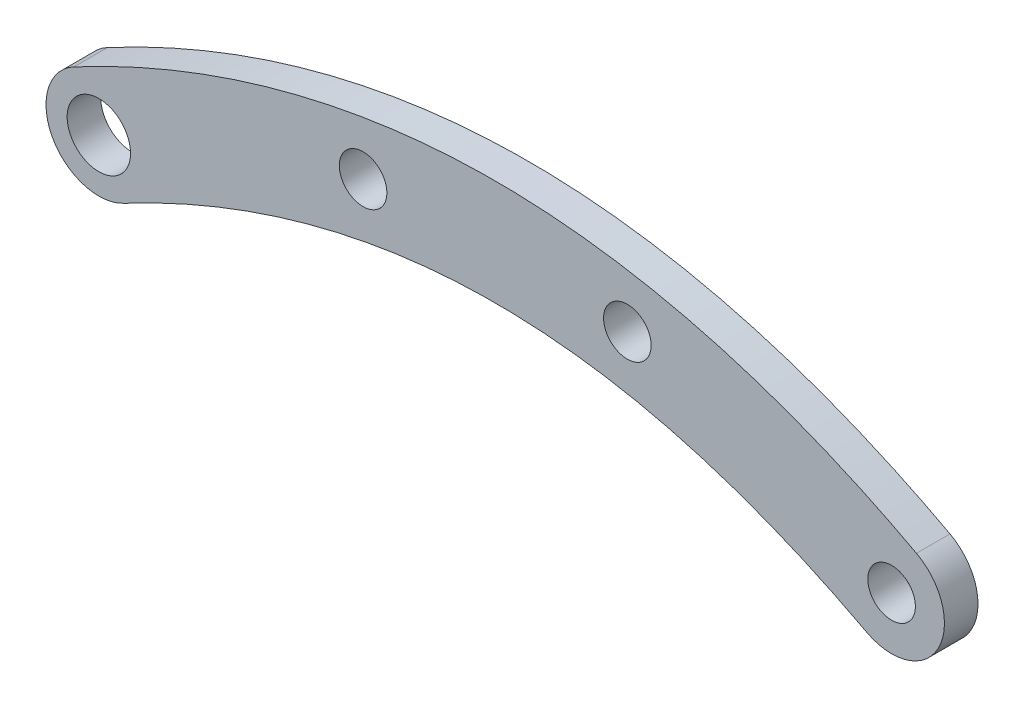
ISO-10303-21;
HEADER;
FILE_DESCRIPTION(('STEP AP214'),'2;1');
FILE_NAME('part.step','',(''),(''),'','','');
FILE_SCHEMA(('AUTOMOTIVE_DESIGN { 1 0 10303 214 1 1 1 1 }'));
ENDSEC;
DATA;
#1=APPLICATION_CONTEXT('core data for automotive mechanical design processes');
#2=APPLICATION_PROTOCOL_DEFINITION('international standard','automotive_design',2000,#1);
#3=PRODUCT_CONTEXT('',#1,'mechanical');
#4=PRODUCT('Part','Part','',(#3));
#5=PRODUCT_RELATED_PRODUCT_CATEGORY('part','',(#4));
#6=PRODUCT_DEFINITION_FORMATION('','',#4);
#7=PRODUCT_DEFINITION_CONTEXT('part definition',#1,'design');
#8=PRODUCT_DEFINITION('design','',#6,#7);
#9=PRODUCT_DEFINITION_SHAPE('','',#8);
#10=(LENGTH_UNIT() NAMED_UNIT(*) SI_UNIT(.MILLI.,.METRE.));
#11=(NAMED_UNIT(*) PLANE_ANGLE_UNIT() SI_UNIT($,.RADIAN.));
#12=(NAMED_UNIT(*) SI_UNIT($,.STERADIAN.) SOLID_ANGLE_UNIT());
#13=UNCERTAINTY_MEASURE_WITH_UNIT(LENGTH_MEASURE(1.E-05),#10,'distance_accuracy_value','');
#14=(GEOMETRIC_REPRESENTATION_CONTEXT(3) GLOBAL_UNCERTAINTY_ASSIGNED_CONTEXT((#13)) GLOBAL_UNIT_ASSIGNED_CONTEXT((#10,
#11,#12)) REPRESENTATION_CONTEXT('',''));
#15=CARTESIAN_POINT('',(0.,0.,0.));
#16=DIRECTION('',(0.,0.,1.));
#17=DIRECTION('',(1.,0.,0.));
#18=AXIS2_PLACEMENT_3D('',#15,#16,#17);
#19=CARTESIAN_POINT('',(-39.8529411764706,-5.58823529411765,1.5875));
#20=CARTESIAN_POINT('',(-25.0878353747758,2.31376151523475,1.5875));
#21=CARTESIAN_POINT('',(0.,5.67155962119131,1.5875));
#22=CARTESIAN_POINT('',(25.0878353747758,2.31376151523475,1.5875));
#23=CARTESIAN_POINT('',(39.8529411764706,-5.58823529411765,1.5875));
#24=B_SPLINE_CURVE_WITH_KNOTS('',2,(#19,#20,#21,#22,#23),.UNSPECIFIED.,.F.,.F.,(3,1,1,3),(0.,
0.375,0.625,1.),.UNSPECIFIED.);
#25=DIRECTION('',(0.,0.,-1.));
#26=VECTOR('',#25,1.);
#27=SURFACE_OF_LINEAR_EXTRUSION('',#24,#26);
#28=CARTESIAN_POINT('',(-39.8529411764706,-5.58823529411765,-1.5875));
#29=CARTESIAN_POINT('',(-25.0878353747758,2.31376151523475,-1.5875));
#30=CARTESIAN_POINT('',(0.,5.67155962119131,-1.5875));
#31=CARTESIAN_POINT('',(25.0878353747758,2.31376151523475,-1.5875));
#32=CARTESIAN_POINT('',(39.8529411764706,-5.58823529411765,-1.5875));
#33=B_SPLINE_CURVE_WITH_KNOTS('',2,(#28,#29,#30,#31,#32),.UNSPECIFIED.,.F.,.F.,(3,1,1,3),(0.,
0.375,0.625,1.),.UNSPECIFIED.);
#34=CARTESIAN_POINT('',(-39.8529411764706,-5.58823529411764,-1.5875));
#35=VERTEX_POINT('',#34);
#36=CARTESIAN_POINT('',(39.8529411764706,-5.58823529411765,-1.5875));
#37=VERTEX_POINT('',#36);
#38=EDGE_CURVE('E137',#35,#37,#33,.T.);
#39=ORIENTED_EDGE('',*,*,#38,.F.);
#40=DIRECTION('',(0.,0.,-1.));
#41=VECTOR('',#40,1.);
#42=CARTESIAN_POINT('',(-39.8529411764706,-5.58823529411764,1.5875));
#43=LINE('',#42,#41);
#44=CARTESIAN_POINT('',(-39.8529411764706,-5.58823529411764,1.5875));
#45=VERTEX_POINT('',#44);
#46=EDGE_CURVE('E11',#45,#35,#43,.T.);
#47=ORIENTED_EDGE('',*,*,#46,.F.);
#48=CARTESIAN_POINT('',(39.8529411764706,-5.58823529411765,1.5875));
#49=VERTEX_POINT('',#48);
#50=EDGE_CURVE('E108',#45,#49,#24,.T.);
#51=ORIENTED_EDGE('',*,*,#50,.T.);
#52=DIRECTION('',(0.,0.,-1.));
#53=VECTOR('',#52,1.);
#54=CARTESIAN_POINT('',(39.8529411764706,-5.58823529411765,1.5875));
#55=LINE('',#54,#53);
#56=EDGE_CURVE('E87',#49,#37,#55,.T.);
#57=ORIENTED_EDGE('',*,*,#56,.T.);
#58=EDGE_LOOP('',(#39,#47,#51,#57));
#59=FACE_BOUND('',#58,.T.);
#60=ADVANCED_FACE('F47',(#59),#27,.T.);
#61=CARTESIAN_POINT('',(-37.5,-10.,1.5875));
#62=DIRECTION('',(0.,0.,-1.));
#63=DIRECTION('',(-1.,0.,0.));
#64=AXIS2_PLACEMENT_3D('',#61,#62,#63);
#65=CYLINDRICAL_SURFACE('',#64,5.);
#66=CARTESIAN_POINT('',(-37.5,-10.,-1.5875));
#67=DIRECTION('',(0.,0.,1.));
#68=DIRECTION('',(1.,0.,0.));
#69=AXIS2_PLACEMENT_3D('',#66,#67,#68);
#70=CIRCLE('',#69,5.);
#71=CARTESIAN_POINT('',(-35.1470588235294,-14.4117647058824,-1.5875));
#72=VERTEX_POINT('',#71);
#73=EDGE_CURVE('E100',#72,#35,#70,.F.);
#74=ORIENTED_EDGE('',*,*,#73,.F.);
#75=DIRECTION('',(0.,0.,-1.));
#76=VECTOR('',#75,1.);
#77=CARTESIAN_POINT('',(-35.1470588235294,-14.4117647058824,1.5875));
#78=LINE('',#77,#76);
#79=CARTESIAN_POINT('',(-35.1470588235294,-14.4117647058824,1.5875));
#80=VERTEX_POINT('',#79);
#81=EDGE_CURVE('E57',#80,#72,#78,.T.);
#82=ORIENTED_EDGE('',*,*,#81,.F.);
#83=CARTESIAN_POINT('',(-37.5,-10.,1.5875));
#84=DIRECTION('',(0.,0.,1.));
#85=DIRECTION('',(1.,0.,0.));
#86=AXIS2_PLACEMENT_3D('',#83,#84,#85);
#87=CIRCLE('',#86,5.);
#88=EDGE_CURVE('E98',#80,#45,#87,.F.);
#89=ORIENTED_EDGE('',*,*,#88,.T.);
#90=ORIENTED_EDGE('',*,*,#46,.T.);
#91=EDGE_LOOP('',(#74,#82,#89,#90));
#92=FACE_BOUND('',#91,.T.);
#93=ADVANCED_FACE('F96',(#92),#65,.T.);
#94=CARTESIAN_POINT('',(-35.1470588235294,-14.4117647058824,1.5875));
#95=CARTESIAN_POINT('',(-21.7871646252242,-7.31376151523475,1.5875));
#96=CARTESIAN_POINT('',(0.,-4.42155962119131,1.5875));
#97=CARTESIAN_POINT('',(21.7871646252242,-7.31376151523475,1.5875));
#98=CARTESIAN_POINT('',(35.1470588235294,-14.4117647058824,1.5875));
#99=B_SPLINE_CURVE_WITH_KNOTS('',2,(#94,#95,#96,#97,#98),.UNSPECIFIED.,.F.,.F.,(3,1,1,3),(0.,
0.375,0.625,1.),.UNSPECIFIED.);
#100=DIRECTION('',(0.,0.,-1.));
#101=VECTOR('',#100,1.);
#102=SURFACE_OF_LINEAR_EXTRUSION('',#99,#101);
#103=CARTESIAN_POINT('',(-35.1470588235294,-14.4117647058824,-1.5875));
#104=CARTESIAN_POINT('',(-21.7871646252242,-7.31376151523475,-1.5875));
#105=CARTESIAN_POINT('',(0.,-4.42155962119131,-1.5875));
#106=CARTESIAN_POINT('',(21.7871646252242,-7.31376151523475,-1.5875));
#107=CARTESIAN_POINT('',(35.1470588235294,-14.4117647058824,-1.5875));
#108=B_SPLINE_CURVE_WITH_KNOTS('',2,(#103,#104,#105,#106,#107),.UNSPECIFIED.,.F.,.F.,(3,1,1,3),
(0.,0.375,0.625,1.),.UNSPECIFIED.);
#109=CARTESIAN_POINT('',(35.1470588235294,-14.4117647058824,-1.5875));
#110=VERTEX_POINT('',#109);
#111=EDGE_CURVE('E80',#72,#110,#108,.T.);
#112=ORIENTED_EDGE('',*,*,#111,.T.);
#113=DIRECTION('',(0.,0.,-1.));
#114=VECTOR('',#113,1.);
#115=CARTESIAN_POINT('',(35.1470588235294,-14.4117647058824,1.5875));
#116=LINE('',#115,#114);
#117=CARTESIAN_POINT('',(35.1470588235294,-14.4117647058824,1.5875));
#118=VERTEX_POINT('',#117);
#119=EDGE_CURVE('E102',#118,#110,#116,.T.);
#120=ORIENTED_EDGE('',*,*,#119,.F.);
#121=EDGE_CURVE('E103',#80,#118,#99,.T.);
#122=ORIENTED_EDGE('',*,*,#121,.F.);
#123=ORIENTED_EDGE('',*,*,#81,.T.);
#124=EDGE_LOOP('',(#112,#120,#122,#123));
#125=FACE_BOUND('',#124,.T.);
#126=ADVANCED_FACE('F104',(#125),#102,.F.);
#127=CARTESIAN_POINT('',(37.5,-10.,1.5875));
#128=DIRECTION('',(0.,0.,-1.));
#129=DIRECTION('',(-1.,0.,0.));
#130=AXIS2_PLACEMENT_3D('',#127,#128,#129);
#131=CYLINDRICAL_SURFACE('',#130,5.);
#132=CARTESIAN_POINT('',(37.5,-10.,-1.5875));
#133=DIRECTION('',(0.,0.,1.));
#134=DIRECTION('',(1.,0.,0.));
#135=AXIS2_PLACEMENT_3D('',#132,#133,#134);
#136=CIRCLE('',#135,5.);
#137=EDGE_CURVE('E112',#110,#37,#136,.T.);
#138=ORIENTED_EDGE('',*,*,#137,.T.);
#139=ORIENTED_EDGE('',*,*,#56,.F.);
#140=CARTESIAN_POINT('',(37.5,-10.,1.5875));
#141=DIRECTION('',(0.,0.,1.));
#142=DIRECTION('',(1.,0.,0.));
#143=AXIS2_PLACEMENT_3D('',#140,#141,#142);
#144=CIRCLE('',#143,5.);
#145=EDGE_CURVE('E65',#118,#49,#144,.T.);
#146=ORIENTED_EDGE('',*,*,#145,.F.);
#147=ORIENTED_EDGE('',*,*,#119,.T.);
#148=EDGE_LOOP('',(#138,#139,#146,#147));
#149=FACE_BOUND('',#148,.T.);
#150=ADVANCED_FACE('F128',(#149),#131,.T.);
#151=CARTESIAN_POINT('',(0.,0.,1.5875));
#152=DIRECTION('',(0.,0.,1.));
#153=DIRECTION('',(1.,0.,0.));
#154=AXIS2_PLACEMENT_3D('',#151,#152,#153);
#155=PLANE('',#154);
#156=CARTESIAN_POINT('',(-37.5,-10.,1.5875));
#157=DIRECTION('',(0.,0.,1.));
#158=DIRECTION('',(1.,0.,0.));
#159=AXIS2_PLACEMENT_3D('',#156,#157,#158);
#160=CIRCLE('',#159,3.);
#161=CARTESIAN_POINT('',(-34.5,-10.,1.5875));
#162=VERTEX_POINT('',#161);
#163=EDGE_CURVE('E197',#162,#162,#160,.T.);
#164=ORIENTED_EDGE('',*,*,#163,.F.);
#165=EDGE_LOOP('',(#164));
#166=FACE_BOUND('',#165,.T.);
#167=CARTESIAN_POINT('',(37.5,-10.,1.5875));
#168=DIRECTION('',(0.,0.,1.));
#169=DIRECTION('',(1.,0.,0.));
#170=AXIS2_PLACEMENT_3D('',#167,#168,#169);
#171=CIRCLE('',#170,2.24999999999999);
#172=CARTESIAN_POINT('',(39.75,-10.,1.5875));
#173=VERTEX_POINT('',#172);
#174=EDGE_CURVE('E201',#173,#173,#171,.T.);
#175=ORIENTED_EDGE('',*,*,#174,.F.);
#176=EDGE_LOOP('',(#175));
#177=FACE_BOUND('',#176,.T.);
#178=CARTESIAN_POINT('',(-12.5,-1.11111111111111,1.5875));
#179=DIRECTION('',(0.,0.,1.));
#180=DIRECTION('',(1.,0.,0.));
#181=AXIS2_PLACEMENT_3D('',#178,#179,#180);
#182=CIRCLE('',#181,2.24999999999999);
#183=CARTESIAN_POINT('',(-10.25,-1.11111111111111,1.5875));
#184=VERTEX_POINT('',#183);
#185=EDGE_CURVE('E211',#184,#184,#182,.T.);
#186=ORIENTED_EDGE('',*,*,#185,.F.);
#187=EDGE_LOOP('',(#186));
#188=FACE_BOUND('',#187,.T.);
#189=CARTESIAN_POINT('',(12.5,-1.11111111111111,1.5875));
#190=DIRECTION('',(0.,0.,1.));
#191=DIRECTION('',(1.,0.,0.));
#192=AXIS2_PLACEMENT_3D('',#189,#190,#191);
#193=CIRCLE('',#192,2.24999999999999);
#194=CARTESIAN_POINT('',(14.75,-1.11111111111111,1.5875));
#195=VERTEX_POINT('',#194);
#196=EDGE_CURVE('E219',#195,#195,#193,.T.);
#197=ORIENTED_EDGE('',*,*,#196,.F.);
#198=EDGE_LOOP('',(#197));
#199=FACE_BOUND('',#198,.T.);
#200=ORIENTED_EDGE('',*,*,#50,.F.);
#201=ORIENTED_EDGE('',*,*,#88,.F.);
#202=ORIENTED_EDGE('',*,*,#121,.T.);
#203=ORIENTED_EDGE('',*,*,#145,.T.);
#204=EDGE_LOOP('',(#200,#201,#202,#203));
#205=FACE_BOUND('',#204,.T.);
#206=ADVANCED_FACE('F107',(#166,#177,#188,#199,#205),#155,.T.);
#207=CARTESIAN_POINT('',(0.,0.,-1.5875));
#208=DIRECTION('',(0.,0.,1.));
#209=DIRECTION('',(1.,0.,0.));
#210=AXIS2_PLACEMENT_3D('',#207,#208,#209);
#211=PLANE('',#210);
#212=CARTESIAN_POINT('',(-37.5,-10.,-1.5875));
#213=DIRECTION('',(0.,0.,1.));
#214=DIRECTION('',(1.,0.,0.));
#215=AXIS2_PLACEMENT_3D('',#212,#213,#214);
#216=CIRCLE('',#215,3.);
#217=CARTESIAN_POINT('',(-34.5,-10.,-1.5875));
#218=VERTEX_POINT('',#217);
#219=EDGE_CURVE('E195',#218,#218,#216,.T.);
#220=ORIENTED_EDGE('',*,*,#219,.T.);
#221=EDGE_LOOP('',(#220));
#222=FACE_BOUND('',#221,.T.);
#223=CARTESIAN_POINT('',(37.5,-10.,-1.5875));
#224=DIRECTION('',(0.,0.,1.));
#225=DIRECTION('',(1.,0.,0.));
#226=AXIS2_PLACEMENT_3D('',#223,#224,#225);
#227=CIRCLE('',#226,2.25);
#228=CARTESIAN_POINT('',(39.75,-10.,-1.5875));
#229=VERTEX_POINT('',#228);
#230=EDGE_CURVE('E207',#229,#229,#227,.T.);
#231=ORIENTED_EDGE('',*,*,#230,.T.);
#232=EDGE_LOOP('',(#231));
#233=FACE_BOUND('',#232,.T.);
#234=CARTESIAN_POINT('',(-12.5,-1.11111111111111,-1.5875));
#235=DIRECTION('',(0.,0.,1.));
#236=DIRECTION('',(1.,0.,0.));
#237=AXIS2_PLACEMENT_3D('',#234,#235,#236);
#238=CIRCLE('',#237,2.25);
#239=CARTESIAN_POINT('',(-10.25,-1.11111111111111,-1.5875));
#240=VERTEX_POINT('',#239);
#241=EDGE_CURVE('E215',#240,#240,#238,.T.);
#242=ORIENTED_EDGE('',*,*,#241,.T.);
#243=EDGE_LOOP('',(#242));
#244=FACE_BOUND('',#243,.T.);
#245=CARTESIAN_POINT('',(12.5,-1.11111111111111,-1.5875));
#246=DIRECTION('',(0.,0.,1.));
#247=DIRECTION('',(1.,0.,0.));
#248=AXIS2_PLACEMENT_3D('',#245,#246,#247);
#249=CIRCLE('',#248,2.25);
#250=CARTESIAN_POINT('',(14.75,-1.11111111111111,-1.5875));
#251=VERTEX_POINT('',#250);
#252=EDGE_CURVE('E141',#251,#251,#249,.T.);
#253=ORIENTED_EDGE('',*,*,#252,.T.);
#254=EDGE_LOOP('',(#253));
#255=FACE_BOUND('',#254,.T.);
#256=ORIENTED_EDGE('',*,*,#38,.T.);
#257=ORIENTED_EDGE('',*,*,#137,.F.);
#258=ORIENTED_EDGE('',*,*,#111,.F.);
#259=ORIENTED_EDGE('',*,*,#73,.T.);
#260=EDGE_LOOP('',(#256,#257,#258,#259));
#261=FACE_BOUND('',#260,.T.);
#262=ADVANCED_FACE('F142',(#222,#233,#244,#255,#261),#211,.F.);
#263=CARTESIAN_POINT('',(12.5,-1.11111111111111,1.5875));
#264=DIRECTION('',(0.,0.,1.));
#265=DIRECTION('',(1.,0.,0.));
#266=AXIS2_PLACEMENT_3D('',#263,#264,#265);
#267=CYLINDRICAL_SURFACE('',#266,2.24999999999999);
#268=ORIENTED_EDGE('',*,*,#252,.F.);
#269=EDGE_LOOP('',(#268));
#270=FACE_BOUND('',#269,.T.);
#271=ORIENTED_EDGE('',*,*,#196,.T.);
#272=EDGE_LOOP('',(#271));
#273=FACE_BOUND('',#272,.T.);
#274=ADVANCED_FACE('F173',(#270,#273),#267,.F.);
#275=CARTESIAN_POINT('',(-12.5,-1.11111111111111,1.5875));
#276=DIRECTION('',(0.,0.,1.));
#277=DIRECTION('',(1.,0.,0.));
#278=AXIS2_PLACEMENT_3D('',#275,#276,#277);
#279=CYLINDRICAL_SURFACE('',#278,2.24999999999999);
#280=ORIENTED_EDGE('',*,*,#241,.F.);
#281=EDGE_LOOP('',(#280));
#282=FACE_BOUND('',#281,.T.);
#283=ORIENTED_EDGE('',*,*,#185,.T.);
#284=EDGE_LOOP('',(#283));
#285=FACE_BOUND('',#284,.T.);
#286=ADVANCED_FACE('F179',(#282,#285),#279,.F.);
#287=CARTESIAN_POINT('',(37.5,-10.,1.5875));
#288=DIRECTION('',(0.,0.,1.));
#289=DIRECTION('',(1.,0.,0.));
#290=AXIS2_PLACEMENT_3D('',#287,#288,#289);
#291=CYLINDRICAL_SURFACE('',#290,2.25);
#292=ORIENTED_EDGE('',*,*,#230,.F.);
#293=EDGE_LOOP('',(#292));
#294=FACE_BOUND('',#293,.T.);
#295=ORIENTED_EDGE('',*,*,#174,.T.);
#296=EDGE_LOOP('',(#295));
#297=FACE_BOUND('',#296,.T.);
#298=ADVANCED_FACE('F183',(#294,#297),#291,.F.);
#299=CARTESIAN_POINT('',(-37.5,-10.,-1.5875));
#300=DIRECTION('',(0.,0.,1.));
#301=DIRECTION('',(1.,0.,0.));
#302=AXIS2_PLACEMENT_3D('',#299,#300,#301);
#303=CYLINDRICAL_SURFACE('',#302,3.);
#304=ORIENTED_EDGE('',*,*,#219,.F.);
#305=EDGE_LOOP('',(#304));
#306=FACE_BOUND('',#305,.T.);
#307=ORIENTED_EDGE('',*,*,#163,.T.);
#308=EDGE_LOOP('',(#307));
#309=FACE_BOUND('',#308,.T.);
#310=ADVANCED_FACE('F186',(#306,#309),#303,.F.);
#311=CLOSED_SHELL('',(#60,#93,#126,#150,#206,#262,#274,#286,#298,#310));
#312=MANIFOLD_SOLID_BREP('B2',#311);
#313=ADVANCED_BREP_SHAPE_REPRESENTATION('',(#18,#312),#14);
#314=SHAPE_DEFINITION_REPRESENTATION(#9,#313);
ENDSEC;
END-ISO-10303-21;
